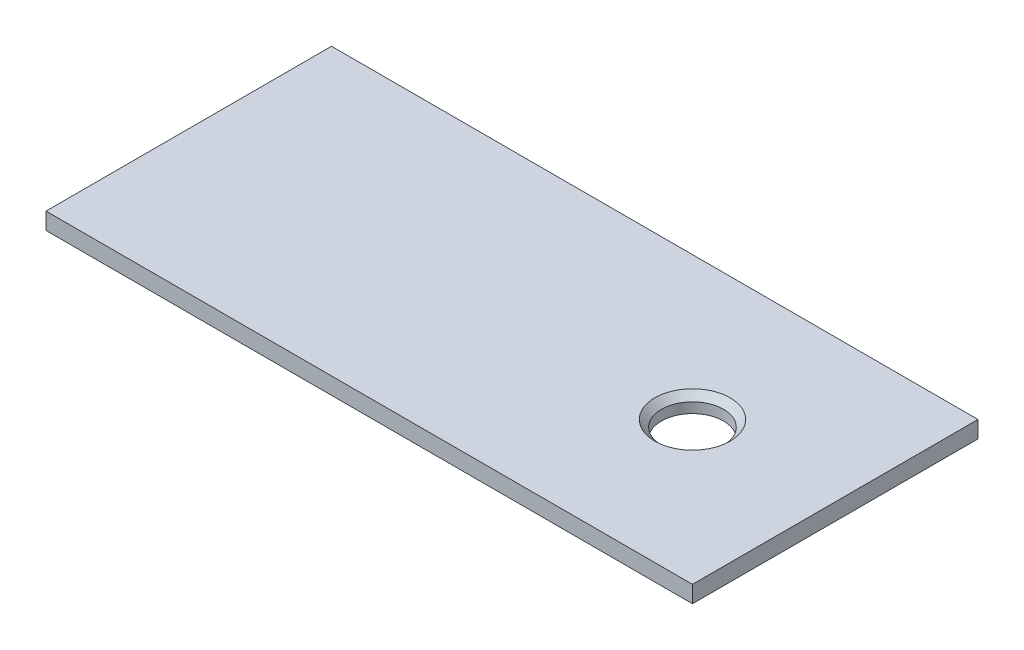
ISO-10303-21;
HEADER;
FILE_DESCRIPTION(('STEP AP214'),'2;1');
FILE_NAME('part.step','',(''),(''),'','','');
FILE_SCHEMA(('AUTOMOTIVE_DESIGN { 1 0 10303 214 1 1 1 1 }'));
ENDSEC;
DATA;
#1=APPLICATION_CONTEXT('core data for automotive mechanical design processes');
#2=APPLICATION_PROTOCOL_DEFINITION('international standard','automotive_design',2000,#1);
#3=PRODUCT_CONTEXT('',#1,'mechanical');
#4=PRODUCT('Part','Part','',(#3));
#5=PRODUCT_RELATED_PRODUCT_CATEGORY('part','',(#4));
#6=PRODUCT_DEFINITION_FORMATION('','',#4);
#7=PRODUCT_DEFINITION_CONTEXT('part definition',#1,'design');
#8=PRODUCT_DEFINITION('design','',#6,#7);
#9=PRODUCT_DEFINITION_SHAPE('','',#8);
#10=(LENGTH_UNIT() NAMED_UNIT(*) SI_UNIT(.MILLI.,.METRE.));
#11=(NAMED_UNIT(*) PLANE_ANGLE_UNIT() SI_UNIT($,.RADIAN.));
#12=(NAMED_UNIT(*) SI_UNIT($,.STERADIAN.) SOLID_ANGLE_UNIT());
#13=UNCERTAINTY_MEASURE_WITH_UNIT(LENGTH_MEASURE(1.E-05),#10,'distance_accuracy_value','');
#14=(GEOMETRIC_REPRESENTATION_CONTEXT(3) GLOBAL_UNCERTAINTY_ASSIGNED_CONTEXT((#13)) GLOBAL_UNIT_ASSIGNED_CONTEXT((#10,
#11,#12)) REPRESENTATION_CONTEXT('',''));
#15=CARTESIAN_POINT('',(0.,0.,0.));
#16=DIRECTION('',(0.,0.,1.));
#17=DIRECTION('',(1.,0.,0.));
#18=AXIS2_PLACEMENT_3D('',#15,#16,#17);
#19=CARTESIAN_POINT('',(60.,3.125,26.5));
#20=DIRECTION('',(-1.,0.,0.));
#21=DIRECTION('',(0.,0.,1.));
#22=AXIS2_PLACEMENT_3D('',#19,#20,#21);
#23=PLANE('',#22);
#24=DIRECTION('',(0.,0.,-1.));
#25=VECTOR('',#24,1.);
#26=CARTESIAN_POINT('',(60.,0.,26.5));
#27=LINE('',#26,#25);
#28=CARTESIAN_POINT('',(60.,0.,26.5));
#29=VERTEX_POINT('',#28);
#30=CARTESIAN_POINT('',(60.,0.,-26.5));
#31=VERTEX_POINT('',#30);
#32=EDGE_CURVE('E123',#29,#31,#27,.T.);
#33=ORIENTED_EDGE('',*,*,#32,.T.);
#34=DIRECTION('',(0.,-1.,0.));
#35=VECTOR('',#34,1.);
#36=CARTESIAN_POINT('',(60.,3.125,-26.5));
#37=LINE('',#36,#35);
#38=CARTESIAN_POINT('',(60.,3.125,-26.5));
#39=VERTEX_POINT('',#38);
#40=EDGE_CURVE('E11',#39,#31,#37,.T.);
#41=ORIENTED_EDGE('',*,*,#40,.F.);
#42=DIRECTION('',(0.,0.,-1.));
#43=VECTOR('',#42,1.);
#44=CARTESIAN_POINT('',(60.,3.125,26.5));
#45=LINE('',#44,#43);
#46=CARTESIAN_POINT('',(60.,3.125,26.5));
#47=VERTEX_POINT('',#46);
#48=EDGE_CURVE('E106',#47,#39,#45,.T.);
#49=ORIENTED_EDGE('',*,*,#48,.F.);
#50=DIRECTION('',(0.,-1.,0.));
#51=VECTOR('',#50,1.);
#52=CARTESIAN_POINT('',(60.,3.125,26.5));
#53=LINE('',#52,#51);
#54=EDGE_CURVE('E119',#47,#29,#53,.T.);
#55=ORIENTED_EDGE('',*,*,#54,.T.);
#56=EDGE_LOOP('',(#33,#41,#49,#55));
#57=FACE_BOUND('',#56,.T.);
#58=ADVANCED_FACE('F53',(#57),#23,.F.);
#59=CARTESIAN_POINT('',(-60.,3.125,-26.5));
#60=DIRECTION('',(0.,0.,1.));
#61=DIRECTION('',(1.,0.,0.));
#62=AXIS2_PLACEMENT_3D('',#59,#60,#61);
#63=PLANE('',#62);
#64=DIRECTION('',(-1.,0.,0.));
#65=VECTOR('',#64,1.);
#66=CARTESIAN_POINT('',(-60.,0.,-26.5));
#67=LINE('',#66,#65);
#68=CARTESIAN_POINT('',(-60.,0.,-26.5));
#69=VERTEX_POINT('',#68);
#70=EDGE_CURVE('E111',#31,#69,#67,.T.);
#71=ORIENTED_EDGE('',*,*,#70,.T.);
#72=DIRECTION('',(0.,-1.,0.));
#73=VECTOR('',#72,1.);
#74=CARTESIAN_POINT('',(-60.,3.125,-26.5));
#75=LINE('',#74,#73);
#76=CARTESIAN_POINT('',(-60.,3.125,-26.5));
#77=VERTEX_POINT('',#76);
#78=EDGE_CURVE('E63',#77,#69,#75,.T.);
#79=ORIENTED_EDGE('',*,*,#78,.F.);
#80=DIRECTION('',(-1.,0.,0.));
#81=VECTOR('',#80,1.);
#82=CARTESIAN_POINT('',(-60.,3.125,-26.5));
#83=LINE('',#82,#81);
#84=EDGE_CURVE('E101',#39,#77,#83,.T.);
#85=ORIENTED_EDGE('',*,*,#84,.F.);
#86=ORIENTED_EDGE('',*,*,#40,.T.);
#87=EDGE_LOOP('',(#71,#79,#85,#86));
#88=FACE_BOUND('',#87,.T.);
#89=ADVANCED_FACE('F110',(#88),#63,.F.);
#90=CARTESIAN_POINT('',(-60.,3.125,26.5));
#91=DIRECTION('',(1.,0.,0.));
#92=DIRECTION('',(0.,0.,-1.));
#93=AXIS2_PLACEMENT_3D('',#90,#91,#92);
#94=PLANE('',#93);
#95=DIRECTION('',(0.,0.,1.));
#96=VECTOR('',#95,1.);
#97=CARTESIAN_POINT('',(-60.,0.,26.5));
#98=LINE('',#97,#96);
#99=CARTESIAN_POINT('',(-60.,0.,26.5));
#100=VERTEX_POINT('',#99);
#101=EDGE_CURVE('E88',#69,#100,#98,.T.);
#102=ORIENTED_EDGE('',*,*,#101,.T.);
#103=DIRECTION('',(0.,-1.,0.));
#104=VECTOR('',#103,1.);
#105=CARTESIAN_POINT('',(-60.,3.125,26.5));
#106=LINE('',#105,#104);
#107=CARTESIAN_POINT('',(-60.,3.125,26.5));
#108=VERTEX_POINT('',#107);
#109=EDGE_CURVE('E113',#108,#100,#106,.T.);
#110=ORIENTED_EDGE('',*,*,#109,.F.);
#111=DIRECTION('',(0.,0.,1.));
#112=VECTOR('',#111,1.);
#113=CARTESIAN_POINT('',(-60.,3.125,26.5));
#114=LINE('',#113,#112);
#115=EDGE_CURVE('E104',#77,#108,#114,.T.);
#116=ORIENTED_EDGE('',*,*,#115,.F.);
#117=ORIENTED_EDGE('',*,*,#78,.T.);
#118=EDGE_LOOP('',(#102,#110,#116,#117));
#119=FACE_BOUND('',#118,.T.);
#120=ADVANCED_FACE('F115',(#119),#94,.F.);
#121=CARTESIAN_POINT('',(-60.,3.125,26.5));
#122=DIRECTION('',(0.,0.,-1.));
#123=DIRECTION('',(-1.,0.,0.));
#124=AXIS2_PLACEMENT_3D('',#121,#122,#123);
#125=PLANE('',#124);
#126=DIRECTION('',(1.,0.,0.));
#127=VECTOR('',#126,1.);
#128=CARTESIAN_POINT('',(-60.,0.,26.5));
#129=LINE('',#128,#127);
#130=EDGE_CURVE('E94',#100,#29,#129,.T.);
#131=ORIENTED_EDGE('',*,*,#130,.T.);
#132=ORIENTED_EDGE('',*,*,#54,.F.);
#133=DIRECTION('',(1.,0.,0.));
#134=VECTOR('',#133,1.);
#135=CARTESIAN_POINT('',(-60.,3.125,26.5));
#136=LINE('',#135,#134);
#137=EDGE_CURVE('E71',#108,#47,#136,.T.);
#138=ORIENTED_EDGE('',*,*,#137,.F.);
#139=ORIENTED_EDGE('',*,*,#109,.T.);
#140=EDGE_LOOP('',(#131,#132,#138,#139));
#141=FACE_BOUND('',#140,.T.);
#142=ADVANCED_FACE('F136',(#141),#125,.F.);
#143=CARTESIAN_POINT('',(0.,3.125,0.));
#144=DIRECTION('',(0.,-1.,0.));
#145=DIRECTION('',(0.,0.,-1.));
#146=AXIS2_PLACEMENT_3D('',#143,#144,#145);
#147=PLANE('',#146);
#148=CARTESIAN_POINT('',(33.5,3.125,0.));
#149=DIRECTION('',(0.,1.,0.));
#150=DIRECTION('',(0.,0.,1.));
#151=AXIS2_PLACEMENT_3D('',#148,#149,#150);
#152=CIRCLE('',#151,6.985);
#153=CARTESIAN_POINT('',(33.5,3.125,6.985));
#154=VERTEX_POINT('',#153);
#155=EDGE_CURVE('E147',#154,#154,#152,.T.);
#156=ORIENTED_EDGE('',*,*,#155,.F.);
#157=EDGE_LOOP('',(#156));
#158=FACE_BOUND('',#157,.T.);
#159=ORIENTED_EDGE('',*,*,#48,.T.);
#160=ORIENTED_EDGE('',*,*,#84,.T.);
#161=ORIENTED_EDGE('',*,*,#115,.T.);
#162=ORIENTED_EDGE('',*,*,#137,.T.);
#163=EDGE_LOOP('',(#159,#160,#161,#162));
#164=FACE_BOUND('',#163,.T.);
#165=ADVANCED_FACE('F102',(#158,#164),#147,.F.);
#166=CARTESIAN_POINT('',(0.,0.,0.));
#167=DIRECTION('',(0.,-1.,0.));
#168=DIRECTION('',(0.,0.,-1.));
#169=AXIS2_PLACEMENT_3D('',#166,#167,#168);
#170=PLANE('',#169);
#171=CARTESIAN_POINT('',(33.5,0.,0.));
#172=DIRECTION('',(0.,-1.,0.));
#173=DIRECTION('',(0.,0.,-1.));
#174=AXIS2_PLACEMENT_3D('',#171,#172,#173);
#175=CIRCLE('',#174,5.75436999999999);
#176=CARTESIAN_POINT('',(33.5,0.,-5.75436999999999));
#177=VERTEX_POINT('',#176);
#178=EDGE_CURVE('E56',#177,#177,#175,.T.);
#179=ORIENTED_EDGE('',*,*,#178,.F.);
#180=EDGE_LOOP('',(#179));
#181=FACE_BOUND('',#180,.T.);
#182=ORIENTED_EDGE('',*,*,#32,.F.);
#183=ORIENTED_EDGE('',*,*,#130,.F.);
#184=ORIENTED_EDGE('',*,*,#101,.F.);
#185=ORIENTED_EDGE('',*,*,#70,.F.);
#186=EDGE_LOOP('',(#182,#183,#184,#185));
#187=FACE_BOUND('',#186,.T.);
#188=ADVANCED_FACE('F139',(#181,#187),#170,.T.);
#189=CARTESIAN_POINT('',(33.5,3.125,0.));
#190=DIRECTION('',(0.,1.,0.));
#191=DIRECTION('',(0.,0.,1.));
#192=AXIS2_PLACEMENT_3D('',#189,#190,#191);
#193=CYLINDRICAL_SURFACE('',#192,5.75436999999999);
#194=ORIENTED_EDGE('',*,*,#178,.T.);
#195=EDGE_LOOP('',(#194));
#196=FACE_BOUND('',#195,.T.);
#197=CARTESIAN_POINT('',(33.5,1.89436999999999,0.));
#198=DIRECTION('',(0.,1.,0.));
#199=DIRECTION('',(0.,0.,1.));
#200=AXIS2_PLACEMENT_3D('',#197,#198,#199);
#201=CIRCLE('',#200,5.75436999999999);
#202=CARTESIAN_POINT('',(33.5,1.89436999999999,5.75436999999999));
#203=VERTEX_POINT('',#202);
#204=EDGE_CURVE('E143',#203,#203,#201,.T.);
#205=ORIENTED_EDGE('',*,*,#204,.T.);
#206=EDGE_LOOP('',(#205));
#207=FACE_BOUND('',#206,.T.);
#208=ADVANCED_FACE('F160',(#196,#207),#193,.F.);
#209=CARTESIAN_POINT('',(33.5,3.125,0.));
#210=DIRECTION('',(0.,1.,0.));
#211=DIRECTION('',(0.,0.,1.));
#212=AXIS2_PLACEMENT_3D('',#209,#210,#211);
#213=CONICAL_SURFACE('',#212,6.985,0.785398163397448);
#214=ORIENTED_EDGE('',*,*,#204,.F.);
#215=EDGE_LOOP('',(#214));
#216=FACE_BOUND('',#215,.T.);
#217=ORIENTED_EDGE('',*,*,#155,.T.);
#218=EDGE_LOOP('',(#217));
#219=FACE_BOUND('',#218,.T.);
#220=ADVANCED_FACE('F152',(#216,#219),#213,.F.);
#221=CLOSED_SHELL('',(#58,#89,#120,#142,#165,#188,#208,#220));
#222=MANIFOLD_SOLID_BREP('B2',#221);
#223=ADVANCED_BREP_SHAPE_REPRESENTATION('',(#18,#222),#14);
#224=SHAPE_DEFINITION_REPRESENTATION(#9,#223);
ENDSEC;
END-ISO-10303-21;
